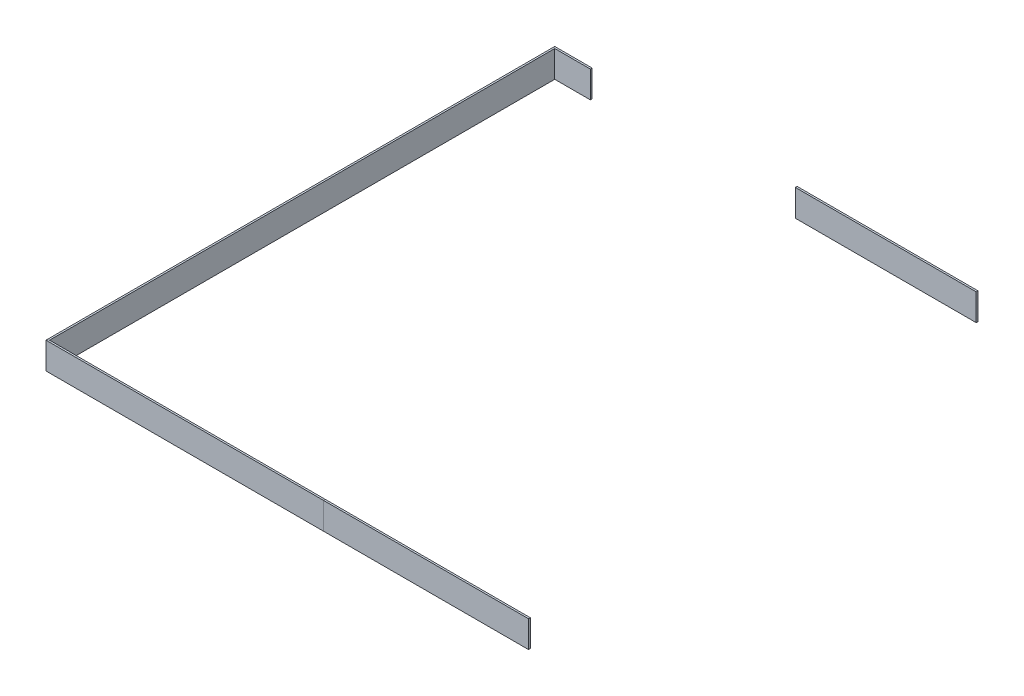
ISO-10303-21;
HEADER;
FILE_DESCRIPTION(('STEP AP214'),'2;1');
FILE_NAME('part.step','',(''),(''),'','','');
FILE_SCHEMA(('AUTOMOTIVE_DESIGN { 1 0 10303 214 1 1 1 1 }'));
ENDSEC;
DATA;
#1=APPLICATION_CONTEXT('core data for automotive mechanical design processes');
#2=APPLICATION_PROTOCOL_DEFINITION('international standard','automotive_design',2000,#1);
#3=PRODUCT_CONTEXT('',#1,'mechanical');
#4=PRODUCT('Part','Part','',(#3));
#5=PRODUCT_RELATED_PRODUCT_CATEGORY('part','',(#4));
#6=PRODUCT_DEFINITION_FORMATION('','',#4);
#7=PRODUCT_DEFINITION_CONTEXT('part definition',#1,'design');
#8=PRODUCT_DEFINITION('design','',#6,#7);
#9=PRODUCT_DEFINITION_SHAPE('','',#8);
#10=(LENGTH_UNIT() NAMED_UNIT(*) SI_UNIT(.MILLI.,.METRE.));
#11=(NAMED_UNIT(*) PLANE_ANGLE_UNIT() SI_UNIT($,.RADIAN.));
#12=(NAMED_UNIT(*) SI_UNIT($,.STERADIAN.) SOLID_ANGLE_UNIT());
#13=UNCERTAINTY_MEASURE_WITH_UNIT(LENGTH_MEASURE(1.E-05),#10,'distance_accuracy_value','');
#14=(GEOMETRIC_REPRESENTATION_CONTEXT(3) GLOBAL_UNCERTAINTY_ASSIGNED_CONTEXT((#13)) GLOBAL_UNIT_ASSIGNED_CONTEXT((#10,
#11,#12)) REPRESENTATION_CONTEXT('',''));
#15=CARTESIAN_POINT('',(0.,0.,0.));
#16=DIRECTION('',(0.,0.,1.));
#17=DIRECTION('',(1.,0.,0.));
#18=AXIS2_PLACEMENT_3D('',#15,#16,#17);
#19=CARTESIAN_POINT('',(-146.05,19.05,180.18125));
#20=DIRECTION('',(0.,-1.,0.));
#21=DIRECTION('',(0.,0.,-1.));
#22=AXIS2_PLACEMENT_3D('',#19,#20,#21);
#23=PLANE('',#22);
#24=DIRECTION('',(0.,0.,-1.));
#25=VECTOR('',#24,1.);
#26=CARTESIAN_POINT('',(-146.05,19.05,180.18125));
#27=LINE('',#26,#25);
#28=CARTESIAN_POINT('',(-146.05,19.05,361.6325));
#29=VERTEX_POINT('',#28);
#30=CARTESIAN_POINT('',(-146.05,19.05,360.3625));
#31=VERTEX_POINT('',#30);
#32=EDGE_CURVE('E147',#29,#31,#27,.T.);
#33=ORIENTED_EDGE('',*,*,#32,.F.);
#34=DIRECTION('',(1.,0.,0.));
#35=VECTOR('',#34,1.);
#36=CARTESIAN_POINT('',(-146.05,19.05,361.6325));
#37=LINE('',#36,#35);
#38=CARTESIAN_POINT('',(-1.11022302462516E-13,19.05,361.6325));
#39=VERTEX_POINT('',#38);
#40=EDGE_CURVE('E212',#29,#39,#37,.T.);
#41=ORIENTED_EDGE('',*,*,#40,.T.);
#42=DIRECTION('',(0.,0.,-1.));
#43=VECTOR('',#42,1.);
#44=CARTESIAN_POINT('',(-1.11022302462516E-13,19.05,180.18125));
#45=LINE('',#44,#43);
#46=CARTESIAN_POINT('',(-1.11022302462516E-13,19.05,360.3625));
#47=VERTEX_POINT('',#46);
#48=EDGE_CURVE('E210',#39,#47,#45,.T.);
#49=ORIENTED_EDGE('',*,*,#48,.T.);
#50=DIRECTION('',(1.,0.,0.));
#51=VECTOR('',#50,1.);
#52=CARTESIAN_POINT('',(-146.05,19.05,360.3625));
#53=LINE('',#52,#51);
#54=EDGE_CURVE('E203',#31,#47,#53,.T.);
#55=ORIENTED_EDGE('',*,*,#54,.F.);
#56=EDGE_LOOP('',(#33,#41,#49,#55));
#57=FACE_BOUND('',#56,.T.);
#58=ADVANCED_FACE('F45',(#57),#23,.F.);
#59=CARTESIAN_POINT('',(-146.05,0.,361.6325));
#60=DIRECTION('',(0.,0.,-1.));
#61=DIRECTION('',(0.,1.,0.));
#62=AXIS2_PLACEMENT_3D('',#59,#60,#61);
#63=PLANE('',#62);
#64=DIRECTION('',(0.,1.,0.));
#65=VECTOR('',#64,1.);
#66=CARTESIAN_POINT('',(-146.05,0.,361.6325));
#67=LINE('',#66,#65);
#68=CARTESIAN_POINT('',(-146.05,0.,361.6325));
#69=VERTEX_POINT('',#68);
#70=EDGE_CURVE('E152',#69,#29,#67,.T.);
#71=ORIENTED_EDGE('',*,*,#70,.F.);
#72=DIRECTION('',(1.,0.,0.));
#73=VECTOR('',#72,1.);
#74=CARTESIAN_POINT('',(-146.05,0.,361.6325));
#75=LINE('',#74,#73);
#76=CARTESIAN_POINT('',(-1.11022302462516E-13,0.,361.6325));
#77=VERTEX_POINT('',#76);
#78=EDGE_CURVE('E209',#69,#77,#75,.T.);
#79=ORIENTED_EDGE('',*,*,#78,.T.);
#80=DIRECTION('',(0.,1.,0.));
#81=VECTOR('',#80,1.);
#82=CARTESIAN_POINT('',(-1.11022302462516E-13,0.,361.6325));
#83=LINE('',#82,#81);
#84=EDGE_CURVE('E207',#77,#39,#83,.T.);
#85=ORIENTED_EDGE('',*,*,#84,.T.);
#86=ORIENTED_EDGE('',*,*,#40,.F.);
#87=EDGE_LOOP('',(#71,#79,#85,#86));
#88=FACE_BOUND('',#87,.T.);
#89=ADVANCED_FACE('F248',(#88),#63,.F.);
#90=CARTESIAN_POINT('',(-146.05,1.98592551970982E-13,180.18125));
#91=DIRECTION('',(0.,1.,0.));
#92=DIRECTION('',(0.,0.,1.));
#93=AXIS2_PLACEMENT_3D('',#90,#91,#92);
#94=PLANE('',#93);
#95=DIRECTION('',(0.,0.,1.));
#96=VECTOR('',#95,1.);
#97=CARTESIAN_POINT('',(-146.05,1.98592551970982E-13,180.18125));
#98=LINE('',#97,#96);
#99=CARTESIAN_POINT('',(-146.05,0.,360.3625));
#100=VERTEX_POINT('',#99);
#101=EDGE_CURVE('E157',#100,#69,#98,.T.);
#102=ORIENTED_EDGE('',*,*,#101,.F.);
#103=DIRECTION('',(1.,0.,0.));
#104=VECTOR('',#103,1.);
#105=CARTESIAN_POINT('',(-146.05,0.,360.3625));
#106=LINE('',#105,#104);
#107=CARTESIAN_POINT('',(-1.11022302462516E-13,0.,360.3625));
#108=VERTEX_POINT('',#107);
#109=EDGE_CURVE('E206',#100,#108,#106,.T.);
#110=ORIENTED_EDGE('',*,*,#109,.T.);
#111=DIRECTION('',(0.,0.,1.));
#112=VECTOR('',#111,1.);
#113=CARTESIAN_POINT('',(-1.11022302462516E-13,1.98592551970982E-13,180.18125));
#114=LINE('',#113,#112);
#115=EDGE_CURVE('E204',#108,#77,#114,.T.);
#116=ORIENTED_EDGE('',*,*,#115,.T.);
#117=ORIENTED_EDGE('',*,*,#78,.F.);
#118=EDGE_LOOP('',(#102,#110,#116,#117));
#119=FACE_BOUND('',#118,.T.);
#120=ADVANCED_FACE('F233',(#119),#94,.F.);
#121=CARTESIAN_POINT('',(-146.05,0.,360.3625));
#122=DIRECTION('',(0.,0.,1.));
#123=DIRECTION('',(1.,0.,0.));
#124=AXIS2_PLACEMENT_3D('',#121,#122,#123);
#125=PLANE('',#124);
#126=DIRECTION('',(0.,-1.,0.));
#127=VECTOR('',#126,1.);
#128=CARTESIAN_POINT('',(-146.05,0.,360.3625));
#129=LINE('',#128,#127);
#130=EDGE_CURVE('E190',#31,#100,#129,.T.);
#131=ORIENTED_EDGE('',*,*,#130,.F.);
#132=ORIENTED_EDGE('',*,*,#54,.T.);
#133=DIRECTION('',(0.,-1.,0.));
#134=VECTOR('',#133,1.);
#135=CARTESIAN_POINT('',(-1.11022302462516E-13,0.,360.3625));
#136=LINE('',#135,#134);
#137=EDGE_CURVE('E199',#47,#108,#136,.T.);
#138=ORIENTED_EDGE('',*,*,#137,.T.);
#139=ORIENTED_EDGE('',*,*,#109,.F.);
#140=EDGE_LOOP('',(#131,#132,#138,#139));
#141=FACE_BOUND('',#140,.T.);
#142=ADVANCED_FACE('F222',(#141),#125,.F.);
#143=CARTESIAN_POINT('',(-162.71875,1.98592551970982E-13,180.18125));
#144=DIRECTION('',(0.,-1.,0.));
#145=DIRECTION('',(0.,0.,-1.));
#146=AXIS2_PLACEMENT_3D('',#143,#144,#145);
#147=PLANE('',#146);
#148=DIRECTION('',(1.,0.,0.));
#149=VECTOR('',#148,1.);
#150=CARTESIAN_POINT('',(-342.9,0.,360.3625));
#151=LINE('',#150,#149);
#152=CARTESIAN_POINT('',(-342.9,0.,360.3625));
#153=VERTEX_POINT('',#152);
#154=EDGE_CURVE('E161',#153,#100,#151,.T.);
#155=ORIENTED_EDGE('',*,*,#154,.T.);
#156=ORIENTED_EDGE('',*,*,#101,.T.);
#157=DIRECTION('',(1.,0.,0.));
#158=VECTOR('',#157,1.);
#159=CARTESIAN_POINT('',(-344.17,0.,361.6325));
#160=LINE('',#159,#158);
#161=CARTESIAN_POINT('',(-344.17,0.,361.6325));
#162=VERTEX_POINT('',#161);
#163=EDGE_CURVE('E156',#162,#69,#160,.T.);
#164=ORIENTED_EDGE('',*,*,#163,.F.);
#165=DIRECTION('',(0.707106781186547,0.,-0.707106781186548));
#166=VECTOR('',#165,1.);
#167=CARTESIAN_POINT('',(-162.71875,1.98592551970982E-13,180.18125));
#168=LINE('',#167,#166);
#169=EDGE_CURVE('E160',#162,#153,#168,.T.);
#170=ORIENTED_EDGE('',*,*,#169,.T.);
#171=EDGE_LOOP('',(#155,#156,#164,#170));
#172=FACE_BOUND('',#171,.T.);
#173=ADVANCED_FACE('F236',(#172),#147,.T.);
#174=CARTESIAN_POINT('',(-344.17,0.,361.6325));
#175=DIRECTION('',(0.,0.,1.));
#176=DIRECTION('',(0.,-1.,0.));
#177=AXIS2_PLACEMENT_3D('',#174,#175,#176);
#178=PLANE('',#177);
#179=ORIENTED_EDGE('',*,*,#163,.T.);
#180=ORIENTED_EDGE('',*,*,#70,.T.);
#181=DIRECTION('',(1.,0.,0.));
#182=VECTOR('',#181,1.);
#183=CARTESIAN_POINT('',(-344.17,19.05,361.6325));
#184=LINE('',#183,#182);
#185=CARTESIAN_POINT('',(-344.17,19.05,361.6325));
#186=VERTEX_POINT('',#185);
#187=EDGE_CURVE('E151',#186,#29,#184,.T.);
#188=ORIENTED_EDGE('',*,*,#187,.F.);
#189=DIRECTION('',(0.,-1.,0.));
#190=VECTOR('',#189,1.);
#191=CARTESIAN_POINT('',(-344.17,0.,361.6325));
#192=LINE('',#191,#190);
#193=EDGE_CURVE('E155',#186,#162,#192,.T.);
#194=ORIENTED_EDGE('',*,*,#193,.T.);
#195=EDGE_LOOP('',(#179,#180,#188,#194));
#196=FACE_BOUND('',#195,.T.);
#197=ADVANCED_FACE('F246',(#196),#178,.T.);
#198=CARTESIAN_POINT('',(-162.71875,19.05,180.18125));
#199=DIRECTION('',(0.,1.,0.));
#200=DIRECTION('',(0.,0.,1.));
#201=AXIS2_PLACEMENT_3D('',#198,#199,#200);
#202=PLANE('',#201);
#203=ORIENTED_EDGE('',*,*,#187,.T.);
#204=ORIENTED_EDGE('',*,*,#32,.T.);
#205=DIRECTION('',(1.,0.,0.));
#206=VECTOR('',#205,1.);
#207=CARTESIAN_POINT('',(-342.9,19.05,360.3625));
#208=LINE('',#207,#206);
#209=CARTESIAN_POINT('',(-342.9,19.05,360.3625));
#210=VERTEX_POINT('',#209);
#211=EDGE_CURVE('E164',#210,#31,#208,.T.);
#212=ORIENTED_EDGE('',*,*,#211,.F.);
#213=DIRECTION('',(-0.707106781186547,0.,0.707106781186548));
#214=VECTOR('',#213,1.);
#215=CARTESIAN_POINT('',(-162.71875,19.05,180.18125));
#216=LINE('',#215,#214);
#217=EDGE_CURVE('E150',#210,#186,#216,.T.);
#218=ORIENTED_EDGE('',*,*,#217,.T.);
#219=EDGE_LOOP('',(#203,#204,#212,#218));
#220=FACE_BOUND('',#219,.T.);
#221=ADVANCED_FACE('F243',(#220),#202,.T.);
#222=CARTESIAN_POINT('',(-342.9,0.,360.3625));
#223=DIRECTION('',(0.,0.,-1.));
#224=DIRECTION('',(-1.,0.,0.));
#225=AXIS2_PLACEMENT_3D('',#222,#223,#224);
#226=PLANE('',#225);
#227=ORIENTED_EDGE('',*,*,#211,.T.);
#228=ORIENTED_EDGE('',*,*,#130,.T.);
#229=ORIENTED_EDGE('',*,*,#154,.F.);
#230=DIRECTION('',(0.,1.,0.));
#231=VECTOR('',#230,1.);
#232=CARTESIAN_POINT('',(-342.9,0.,360.3625));
#233=LINE('',#232,#231);
#234=EDGE_CURVE('E187',#153,#210,#233,.T.);
#235=ORIENTED_EDGE('',*,*,#234,.T.);
#236=EDGE_LOOP('',(#227,#228,#229,#235));
#237=FACE_BOUND('',#236,.T.);
#238=ADVANCED_FACE('F239',(#237),#226,.T.);
#239=CARTESIAN_POINT('',(-353.398643200267,0.,-10.4986432002668));
#240=DIRECTION('',(0.,1.,0.));
#241=DIRECTION('',(-1.,0.,0.));
#242=AXIS2_PLACEMENT_3D('',#239,#240,#241);
#243=PLANE('',#242);
#244=ORIENTED_EDGE('',*,*,#169,.F.);
#245=DIRECTION('',(0.,0.,1.));
#246=VECTOR('',#245,1.);
#247=CARTESIAN_POINT('',(-344.17,0.,-1.27));
#248=LINE('',#247,#246);
#249=CARTESIAN_POINT('',(-344.17,0.,-1.27));
#250=VERTEX_POINT('',#249);
#251=EDGE_CURVE('E176',#250,#162,#248,.T.);
#252=ORIENTED_EDGE('',*,*,#251,.F.);
#253=DIRECTION('',(-0.707106781186548,0.,-0.707106781186547));
#254=VECTOR('',#253,1.);
#255=CARTESIAN_POINT('',(-353.398643200267,0.,-10.4986432002668));
#256=LINE('',#255,#254);
#257=CARTESIAN_POINT('',(-342.9,0.,0.));
#258=VERTEX_POINT('',#257);
#259=EDGE_CURVE('E172',#258,#250,#256,.T.);
#260=ORIENTED_EDGE('',*,*,#259,.F.);
#261=DIRECTION('',(0.,0.,1.));
#262=VECTOR('',#261,1.);
#263=CARTESIAN_POINT('',(-342.9,0.,0.));
#264=LINE('',#263,#262);
#265=EDGE_CURVE('E180',#258,#153,#264,.T.);
#266=ORIENTED_EDGE('',*,*,#265,.T.);
#267=EDGE_LOOP('',(#244,#252,#260,#266));
#268=FACE_BOUND('',#267,.T.);
#269=ADVANCED_FACE('F262',(#268),#243,.F.);
#270=CARTESIAN_POINT('',(-344.17,0.,-1.27));
#271=DIRECTION('',(1.,0.,0.));
#272=DIRECTION('',(0.,0.,-1.));
#273=AXIS2_PLACEMENT_3D('',#270,#271,#272);
#274=PLANE('',#273);
#275=ORIENTED_EDGE('',*,*,#193,.F.);
#276=DIRECTION('',(0.,0.,1.));
#277=VECTOR('',#276,1.);
#278=CARTESIAN_POINT('',(-344.17,19.05,-1.27));
#279=LINE('',#278,#277);
#280=CARTESIAN_POINT('',(-344.17,19.05,-1.27));
#281=VERTEX_POINT('',#280);
#282=EDGE_CURVE('E179',#281,#186,#279,.T.);
#283=ORIENTED_EDGE('',*,*,#282,.F.);
#284=DIRECTION('',(0.,1.,0.));
#285=VECTOR('',#284,1.);
#286=CARTESIAN_POINT('',(-344.17,0.,-1.27));
#287=LINE('',#286,#285);
#288=EDGE_CURVE('E137',#250,#281,#287,.T.);
#289=ORIENTED_EDGE('',*,*,#288,.F.);
#290=ORIENTED_EDGE('',*,*,#251,.T.);
#291=EDGE_LOOP('',(#275,#283,#289,#290));
#292=FACE_BOUND('',#291,.T.);
#293=ADVANCED_FACE('F276',(#292),#274,.F.);
#294=CARTESIAN_POINT('',(-352.763643200267,19.05,-9.86364320026678));
#295=DIRECTION('',(0.,-1.,0.));
#296=DIRECTION('',(0.,0.,-1.));
#297=AXIS2_PLACEMENT_3D('',#294,#295,#296);
#298=PLANE('',#297);
#299=ORIENTED_EDGE('',*,*,#217,.F.);
#300=DIRECTION('',(0.,0.,1.));
#301=VECTOR('',#300,1.);
#302=CARTESIAN_POINT('',(-342.9,19.05,0.));
#303=LINE('',#302,#301);
#304=CARTESIAN_POINT('',(-342.9,19.05,0.));
#305=VERTEX_POINT('',#304);
#306=EDGE_CURVE('E175',#305,#210,#303,.T.);
#307=ORIENTED_EDGE('',*,*,#306,.F.);
#308=DIRECTION('',(0.707106781186548,0.,0.707106781186547));
#309=VECTOR('',#308,1.);
#310=CARTESIAN_POINT('',(-352.763643200267,19.05,-9.86364320026678));
#311=LINE('',#310,#309);
#312=EDGE_CURVE('E142',#281,#305,#311,.T.);
#313=ORIENTED_EDGE('',*,*,#312,.F.);
#314=ORIENTED_EDGE('',*,*,#282,.T.);
#315=EDGE_LOOP('',(#299,#307,#313,#314));
#316=FACE_BOUND('',#315,.T.);
#317=ADVANCED_FACE('F272',(#316),#298,.F.);
#318=CARTESIAN_POINT('',(-342.9,0.,0.));
#319=DIRECTION('',(-1.,0.,0.));
#320=DIRECTION('',(0.,0.,1.));
#321=AXIS2_PLACEMENT_3D('',#318,#319,#320);
#322=PLANE('',#321);
#323=ORIENTED_EDGE('',*,*,#234,.F.);
#324=ORIENTED_EDGE('',*,*,#265,.F.);
#325=DIRECTION('',(0.,-1.,0.));
#326=VECTOR('',#325,1.);
#327=CARTESIAN_POINT('',(-342.9,0.,0.));
#328=LINE('',#327,#326);
#329=EDGE_CURVE('E145',#305,#258,#328,.T.);
#330=ORIENTED_EDGE('',*,*,#329,.F.);
#331=ORIENTED_EDGE('',*,*,#306,.T.);
#332=EDGE_LOOP('',(#323,#324,#330,#331));
#333=FACE_BOUND('',#332,.T.);
#334=ADVANCED_FACE('F269',(#333),#322,.F.);
#335=CARTESIAN_POINT('',(-362.627286400534,0.,-1.27));
#336=DIRECTION('',(0.,-1.,0.));
#337=DIRECTION('',(0.,0.,-1.));
#338=AXIS2_PLACEMENT_3D('',#335,#336,#337);
#339=PLANE('',#338);
#340=DIRECTION('',(0.,0.,-1.));
#341=VECTOR('',#340,1.);
#342=CARTESIAN_POINT('',(-317.5,0.,-1.27));
#343=LINE('',#342,#341);
#344=CARTESIAN_POINT('',(-317.5,0.,0.));
#345=VERTEX_POINT('',#344);
#346=CARTESIAN_POINT('',(-317.5,0.,-1.27));
#347=VERTEX_POINT('',#346);
#348=EDGE_CURVE('E115',#345,#347,#343,.T.);
#349=ORIENTED_EDGE('',*,*,#348,.F.);
#350=DIRECTION('',(1.,0.,0.));
#351=VECTOR('',#350,1.);
#352=CARTESIAN_POINT('',(-362.627286400534,0.,0.));
#353=LINE('',#352,#351);
#354=EDGE_CURVE('E143',#258,#345,#353,.T.);
#355=ORIENTED_EDGE('',*,*,#354,.F.);
#356=ORIENTED_EDGE('',*,*,#259,.T.);
#357=DIRECTION('',(1.,0.,0.));
#358=VECTOR('',#357,1.);
#359=CARTESIAN_POINT('',(-362.627286400534,0.,-1.27));
#360=LINE('',#359,#358);
#361=EDGE_CURVE('E49',#250,#347,#360,.T.);
#362=ORIENTED_EDGE('',*,*,#361,.T.);
#363=EDGE_LOOP('',(#349,#355,#356,#362));
#364=FACE_BOUND('',#363,.T.);
#365=ADVANCED_FACE('F47',(#364),#339,.T.);
#366=CARTESIAN_POINT('',(-362.627286400534,0.,0.));
#367=DIRECTION('',(0.,0.,1.));
#368=DIRECTION('',(1.,0.,0.));
#369=AXIS2_PLACEMENT_3D('',#366,#367,#368);
#370=PLANE('',#369);
#371=DIRECTION('',(0.,-1.,0.));
#372=VECTOR('',#371,1.);
#373=CARTESIAN_POINT('',(-317.5,0.,0.));
#374=LINE('',#373,#372);
#375=CARTESIAN_POINT('',(-317.5,19.05,0.));
#376=VERTEX_POINT('',#375);
#377=EDGE_CURVE('E13',#376,#345,#374,.T.);
#378=ORIENTED_EDGE('',*,*,#377,.F.);
#379=DIRECTION('',(1.,0.,0.));
#380=VECTOR('',#379,1.);
#381=CARTESIAN_POINT('',(-362.627286400534,19.05,0.));
#382=LINE('',#381,#380);
#383=EDGE_CURVE('E133',#305,#376,#382,.T.);
#384=ORIENTED_EDGE('',*,*,#383,.F.);
#385=ORIENTED_EDGE('',*,*,#329,.T.);
#386=ORIENTED_EDGE('',*,*,#354,.T.);
#387=EDGE_LOOP('',(#378,#384,#385,#386));
#388=FACE_BOUND('',#387,.T.);
#389=ADVANCED_FACE('F291',(#388),#370,.T.);
#390=CARTESIAN_POINT('',(-362.627286400534,19.05,0.));
#391=DIRECTION('',(0.,1.,0.));
#392=DIRECTION('',(0.,0.,1.));
#393=AXIS2_PLACEMENT_3D('',#390,#391,#392);
#394=PLANE('',#393);
#395=DIRECTION('',(0.,0.,1.));
#396=VECTOR('',#395,1.);
#397=CARTESIAN_POINT('',(-317.5,19.05,0.));
#398=LINE('',#397,#396);
#399=CARTESIAN_POINT('',(-317.5,19.05,-1.27));
#400=VERTEX_POINT('',#399);
#401=EDGE_CURVE('E55',#400,#376,#398,.T.);
#402=ORIENTED_EDGE('',*,*,#401,.F.);
#403=DIRECTION('',(1.,0.,0.));
#404=VECTOR('',#403,1.);
#405=CARTESIAN_POINT('',(-362.627286400534,19.05,-1.27));
#406=LINE('',#405,#404);
#407=EDGE_CURVE('E130',#281,#400,#406,.T.);
#408=ORIENTED_EDGE('',*,*,#407,.F.);
#409=ORIENTED_EDGE('',*,*,#312,.T.);
#410=ORIENTED_EDGE('',*,*,#383,.T.);
#411=EDGE_LOOP('',(#402,#408,#409,#410));
#412=FACE_BOUND('',#411,.T.);
#413=ADVANCED_FACE('F128',(#412),#394,.T.);
#414=CARTESIAN_POINT('',(-362.627286400534,0.,-1.27));
#415=DIRECTION('',(0.,0.,-1.));
#416=DIRECTION('',(0.,1.,0.));
#417=AXIS2_PLACEMENT_3D('',#414,#415,#416);
#418=PLANE('',#417);
#419=DIRECTION('',(0.,1.,0.));
#420=VECTOR('',#419,1.);
#421=CARTESIAN_POINT('',(-317.5,0.,-1.27));
#422=LINE('',#421,#420);
#423=EDGE_CURVE('E117',#347,#400,#422,.T.);
#424=ORIENTED_EDGE('',*,*,#423,.F.);
#425=ORIENTED_EDGE('',*,*,#361,.F.);
#426=ORIENTED_EDGE('',*,*,#288,.T.);
#427=ORIENTED_EDGE('',*,*,#407,.T.);
#428=EDGE_LOOP('',(#424,#425,#426,#427));
#429=FACE_BOUND('',#428,.T.);
#430=ADVANCED_FACE('F135',(#429),#418,.T.);
#431=CARTESIAN_POINT('',(-1.11022302462516E-13,9.525,360.9975));
#432=DIRECTION('',(1.,0.,0.));
#433=DIRECTION('',(0.,0.,-1.));
#434=AXIS2_PLACEMENT_3D('',#431,#432,#433);
#435=PLANE('',#434);
#436=ORIENTED_EDGE('',*,*,#137,.F.);
#437=ORIENTED_EDGE('',*,*,#48,.F.);
#438=ORIENTED_EDGE('',*,*,#84,.F.);
#439=ORIENTED_EDGE('',*,*,#115,.F.);
#440=EDGE_LOOP('',(#436,#437,#438,#439));
#441=FACE_BOUND('',#440,.T.);
#442=ADVANCED_FACE('F230',(#441),#435,.T.);
#443=CARTESIAN_POINT('',(-317.5,30.4983038398703,3.81));
#444=DIRECTION('',(-1.,0.,0.));
#445=DIRECTION('',(0.,0.,1.));
#446=AXIS2_PLACEMENT_3D('',#443,#444,#445);
#447=PLANE('',#446);
#448=ORIENTED_EDGE('',*,*,#348,.T.);
#449=ORIENTED_EDGE('',*,*,#423,.T.);
#450=ORIENTED_EDGE('',*,*,#401,.T.);
#451=ORIENTED_EDGE('',*,*,#377,.T.);
#452=EDGE_LOOP('',(#448,#449,#450,#451));
#453=FACE_BOUND('',#452,.T.);
#454=ADVANCED_FACE('F119',(#453),#447,.F.);
#455=CLOSED_SHELL('',(#58,#89,#120,#142,#173,#197,#221,#238,#269,#293,#317,#334,#365,#389,#413,
#430,#442,#454));
#456=MANIFOLD_SOLID_BREP('B2',#455);
#457=CARTESIAN_POINT('',(-42.2402,27.4511463950731,3.81));
#458=DIRECTION('',(-1.,0.,0.));
#459=DIRECTION('',(0.,-1.,0.));
#460=AXIS2_PLACEMENT_3D('',#457,#458,#459);
#461=PLANE('',#460);
#462=DIRECTION('',(0.,0.,-1.));
#463=VECTOR('',#462,1.);
#464=CARTESIAN_POINT('',(-42.2402,0.,-1.27));
#465=LINE('',#464,#463);
#466=CARTESIAN_POINT('',(-42.2402,0.,0.));
#467=VERTEX_POINT('',#466);
#468=CARTESIAN_POINT('',(-42.2402,0.,-1.27));
#469=VERTEX_POINT('',#468);
#470=EDGE_CURVE('E462',#467,#469,#465,.T.);
#471=ORIENTED_EDGE('',*,*,#470,.T.);
#472=DIRECTION('',(0.,1.,0.));
#473=VECTOR('',#472,1.);
#474=CARTESIAN_POINT('',(-42.2402,-1.46782566076773E-13,-1.27));
#475=LINE('',#474,#473);
#476=CARTESIAN_POINT('',(-42.2402,19.05,-1.27));
#477=VERTEX_POINT('',#476);
#478=EDGE_CURVE('E417',#469,#477,#475,.T.);
#479=ORIENTED_EDGE('',*,*,#478,.T.);
#480=DIRECTION('',(0.,0.,1.));
#481=VECTOR('',#480,1.);
#482=CARTESIAN_POINT('',(-42.2402,19.05,0.));
#483=LINE('',#482,#481);
#484=CARTESIAN_POINT('',(-42.2402,19.05,0.));
#485=VERTEX_POINT('',#484);
#486=EDGE_CURVE('E455',#477,#485,#483,.T.);
#487=ORIENTED_EDGE('',*,*,#486,.T.);
#488=DIRECTION('',(0.,-1.,0.));
#489=VECTOR('',#488,1.);
#490=CARTESIAN_POINT('',(-42.2402,-1.45382794785348E-13,0.));
#491=LINE('',#490,#489);
#492=EDGE_CURVE('E466',#485,#467,#491,.T.);
#493=ORIENTED_EDGE('',*,*,#492,.T.);
#494=EDGE_LOOP('',(#471,#479,#487,#493));
#495=FACE_BOUND('',#494,.T.);
#496=ADVANCED_FACE('F409',(#495),#461,.F.);
#497=CARTESIAN_POINT('',(-362.627286400534,0.,-1.27));
#498=DIRECTION('',(0.,0.,-1.));
#499=DIRECTION('',(0.,1.,0.));
#500=AXIS2_PLACEMENT_3D('',#497,#498,#499);
#501=PLANE('',#500);
#502=DIRECTION('',(0.,-1.,0.));
#503=VECTOR('',#502,1.);
#504=CARTESIAN_POINT('',(-171.323,0.,-1.27));
#505=LINE('',#504,#503);
#506=CARTESIAN_POINT('',(-171.323,19.05,-1.27));
#507=VERTEX_POINT('',#506);
#508=CARTESIAN_POINT('',(-171.323,0.,-1.27));
#509=VERTEX_POINT('',#508);
#510=EDGE_CURVE('E43',#507,#509,#505,.T.);
#511=ORIENTED_EDGE('',*,*,#510,.F.);
#512=DIRECTION('',(1.,0.,0.));
#513=VECTOR('',#512,1.);
#514=CARTESIAN_POINT('',(-362.627286400534,19.05,-1.27));
#515=LINE('',#514,#513);
#516=EDGE_CURVE('E461',#507,#477,#515,.T.);
#517=ORIENTED_EDGE('',*,*,#516,.T.);
#518=ORIENTED_EDGE('',*,*,#478,.F.);
#519=DIRECTION('',(1.,0.,0.));
#520=VECTOR('',#519,1.);
#521=CARTESIAN_POINT('',(-362.627286400534,0.,-1.27));
#522=LINE('',#521,#520);
#523=EDGE_CURVE('E431',#509,#469,#522,.T.);
#524=ORIENTED_EDGE('',*,*,#523,.F.);
#525=EDGE_LOOP('',(#511,#517,#518,#524));
#526=FACE_BOUND('',#525,.T.);
#527=ADVANCED_FACE('F459',(#526),#501,.T.);
#528=CARTESIAN_POINT('',(-362.627286400534,19.05,0.));
#529=DIRECTION('',(0.,1.,0.));
#530=DIRECTION('',(0.,0.,1.));
#531=AXIS2_PLACEMENT_3D('',#528,#529,#530);
#532=PLANE('',#531);
#533=DIRECTION('',(0.,0.,-1.));
#534=VECTOR('',#533,1.);
#535=CARTESIAN_POINT('',(-171.323,19.05,0.));
#536=LINE('',#535,#534);
#537=CARTESIAN_POINT('',(-171.323,19.05,0.));
#538=VERTEX_POINT('',#537);
#539=EDGE_CURVE('E423',#538,#507,#536,.T.);
#540=ORIENTED_EDGE('',*,*,#539,.F.);
#541=DIRECTION('',(1.,0.,0.));
#542=VECTOR('',#541,1.);
#543=CARTESIAN_POINT('',(-362.627286400534,19.05,0.));
#544=LINE('',#543,#542);
#545=EDGE_CURVE('E464',#538,#485,#544,.T.);
#546=ORIENTED_EDGE('',*,*,#545,.T.);
#547=ORIENTED_EDGE('',*,*,#486,.F.);
#548=ORIENTED_EDGE('',*,*,#516,.F.);
#549=EDGE_LOOP('',(#540,#546,#547,#548));
#550=FACE_BOUND('',#549,.T.);
#551=ADVANCED_FACE('F482',(#550),#532,.T.);
#552=CARTESIAN_POINT('',(-362.627286400534,0.,0.));
#553=DIRECTION('',(0.,0.,1.));
#554=DIRECTION('',(1.,0.,0.));
#555=AXIS2_PLACEMENT_3D('',#552,#553,#554);
#556=PLANE('',#555);
#557=DIRECTION('',(0.,1.,0.));
#558=VECTOR('',#557,1.);
#559=CARTESIAN_POINT('',(-171.323,0.,0.));
#560=LINE('',#559,#558);
#561=CARTESIAN_POINT('',(-171.323,0.,0.));
#562=VERTEX_POINT('',#561);
#563=EDGE_CURVE('E456',#562,#538,#560,.T.);
#564=ORIENTED_EDGE('',*,*,#563,.F.);
#565=DIRECTION('',(1.,0.,0.));
#566=VECTOR('',#565,1.);
#567=CARTESIAN_POINT('',(-362.627286400534,0.,0.));
#568=LINE('',#567,#566);
#569=EDGE_CURVE('E454',#562,#467,#568,.T.);
#570=ORIENTED_EDGE('',*,*,#569,.T.);
#571=ORIENTED_EDGE('',*,*,#492,.F.);
#572=ORIENTED_EDGE('',*,*,#545,.F.);
#573=EDGE_LOOP('',(#564,#570,#571,#572));
#574=FACE_BOUND('',#573,.T.);
#575=ADVANCED_FACE('F483',(#574),#556,.T.);
#576=CARTESIAN_POINT('',(-362.627286400534,0.,-1.27));
#577=DIRECTION('',(0.,-1.,0.));
#578=DIRECTION('',(0.,0.,-1.));
#579=AXIS2_PLACEMENT_3D('',#576,#577,#578);
#580=PLANE('',#579);
#581=DIRECTION('',(0.,0.,1.));
#582=VECTOR('',#581,1.);
#583=CARTESIAN_POINT('',(-171.323,0.,-1.27));
#584=LINE('',#583,#582);
#585=EDGE_CURVE('E449',#509,#562,#584,.T.);
#586=ORIENTED_EDGE('',*,*,#585,.F.);
#587=ORIENTED_EDGE('',*,*,#523,.T.);
#588=ORIENTED_EDGE('',*,*,#470,.F.);
#589=ORIENTED_EDGE('',*,*,#569,.F.);
#590=EDGE_LOOP('',(#586,#587,#588,#589));
#591=FACE_BOUND('',#590,.T.);
#592=ADVANCED_FACE('F411',(#591),#580,.T.);
#593=CARTESIAN_POINT('',(-171.323,30.4983038398703,3.81));
#594=DIRECTION('',(1.,0.,0.));
#595=DIRECTION('',(0.,0.,-1.));
#596=AXIS2_PLACEMENT_3D('',#593,#594,#595);
#597=PLANE('',#596);
#598=ORIENTED_EDGE('',*,*,#585,.T.);
#599=ORIENTED_EDGE('',*,*,#563,.T.);
#600=ORIENTED_EDGE('',*,*,#539,.T.);
#601=ORIENTED_EDGE('',*,*,#510,.T.);
#602=EDGE_LOOP('',(#598,#599,#600,#601));
#603=FACE_BOUND('',#602,.T.);
#604=ADVANCED_FACE('F448',(#603),#597,.F.);
#605=CLOSED_SHELL('',(#496,#527,#551,#575,#592,#604));
#606=MANIFOLD_SOLID_BREP('B7',#605);
#607=ADVANCED_BREP_SHAPE_REPRESENTATION('',(#18,#456,#606),#14);
#608=SHAPE_DEFINITION_REPRESENTATION(#9,#607);
ENDSEC;
END-ISO-10303-21;
